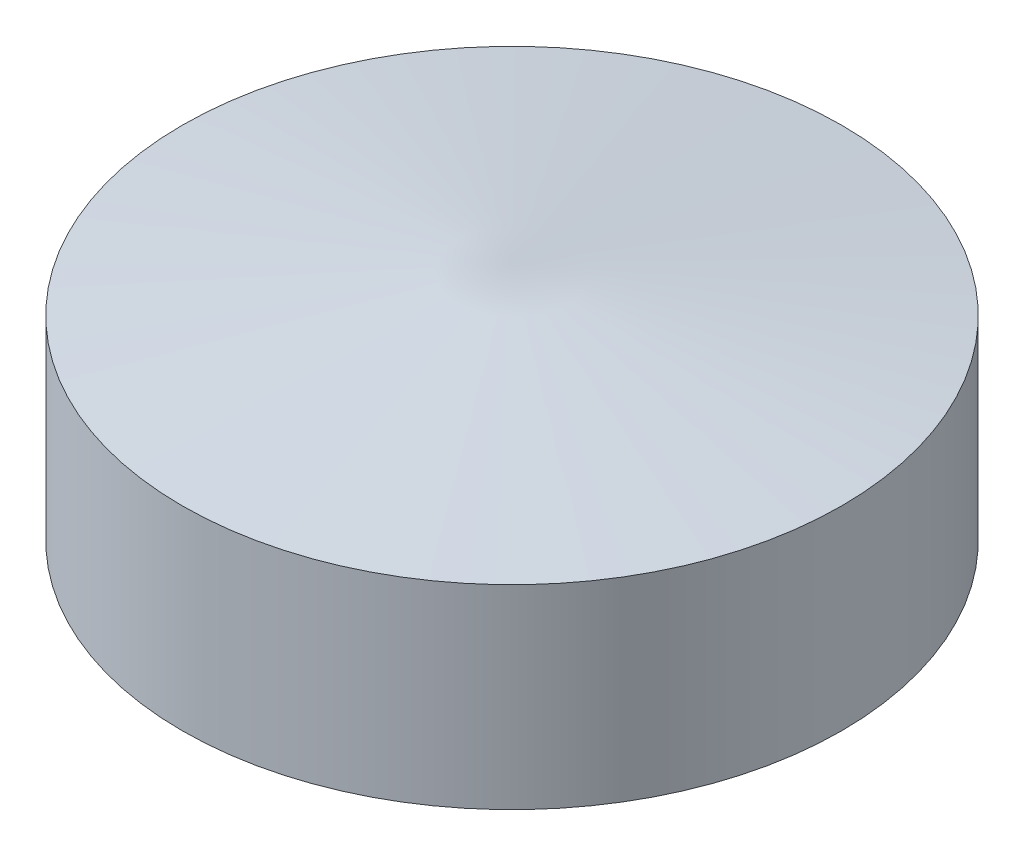
ISO-10303-21;
HEADER;
FILE_DESCRIPTION(('STEP AP214'),'2;1');
FILE_NAME('part.step','',(''),(''),'','','');
FILE_SCHEMA(('AUTOMOTIVE_DESIGN { 1 0 10303 214 1 1 1 1 }'));
ENDSEC;
DATA;
#1=APPLICATION_CONTEXT('core data for automotive mechanical design processes');
#2=APPLICATION_PROTOCOL_DEFINITION('international standard','automotive_design',2000,#1);
#3=PRODUCT_CONTEXT('',#1,'mechanical');
#4=PRODUCT('Part','Part','',(#3));
#5=PRODUCT_RELATED_PRODUCT_CATEGORY('part','',(#4));
#6=PRODUCT_DEFINITION_FORMATION('','',#4);
#7=PRODUCT_DEFINITION_CONTEXT('part definition',#1,'design');
#8=PRODUCT_DEFINITION('design','',#6,#7);
#9=PRODUCT_DEFINITION_SHAPE('','',#8);
#10=(LENGTH_UNIT() NAMED_UNIT(*) SI_UNIT(.MILLI.,.METRE.));
#11=(NAMED_UNIT(*) PLANE_ANGLE_UNIT() SI_UNIT($,.RADIAN.));
#12=(NAMED_UNIT(*) SI_UNIT($,.STERADIAN.) SOLID_ANGLE_UNIT());
#13=UNCERTAINTY_MEASURE_WITH_UNIT(LENGTH_MEASURE(1.E-05),#10,'distance_accuracy_value','');
#14=(GEOMETRIC_REPRESENTATION_CONTEXT(3) GLOBAL_UNCERTAINTY_ASSIGNED_CONTEXT((#13)) GLOBAL_UNIT_ASSIGNED_CONTEXT((#10,
#11,#12)) REPRESENTATION_CONTEXT('',''));
#15=CARTESIAN_POINT('',(0.,0.,0.));
#16=DIRECTION('',(0.,0.,1.));
#17=DIRECTION('',(1.,0.,0.));
#18=AXIS2_PLACEMENT_3D('',#15,#16,#17);
#19=CARTESIAN_POINT('',(0.,0.,0.));
#20=DIRECTION('',(0.,-1.,0.));
#21=DIRECTION('',(0.,0.,-1.));
#22=AXIS2_PLACEMENT_3D('',#19,#20,#21);
#23=CYLINDRICAL_SURFACE('',#22,22.);
#24=CARTESIAN_POINT('',(0.,13.,0.));
#25=DIRECTION('',(0.,-1.,0.));
#26=DIRECTION('',(0.,0.,-1.));
#27=AXIS2_PLACEMENT_3D('',#24,#25,#26);
#28=CIRCLE('',#27,22.);
#29=CARTESIAN_POINT('',(0.,13.,-22.));
#30=VERTEX_POINT('',#29);
#31=EDGE_CURVE('E72',#30,#30,#28,.T.);
#32=ORIENTED_EDGE('',*,*,#31,.T.);
#33=EDGE_LOOP('',(#32));
#34=FACE_BOUND('',#33,.T.);
#35=CARTESIAN_POINT('',(0.,0.,0.));
#36=DIRECTION('',(0.,-1.,0.));
#37=DIRECTION('',(0.,0.,-1.));
#38=AXIS2_PLACEMENT_3D('',#35,#36,#37);
#39=CIRCLE('',#38,22.);
#40=CARTESIAN_POINT('',(-21.9488636363636,0.,-1.49912810403716));
#41=VERTEX_POINT('',#40);
#42=CARTESIAN_POINT('',(-21.9488636363636,0.,1.49912810403716));
#43=VERTEX_POINT('',#42);
#44=EDGE_CURVE('E70',#41,#43,#39,.T.);
#45=ORIENTED_EDGE('',*,*,#44,.F.);
#46=DIRECTION('',(0.,-1.,0.));
#47=VECTOR('',#46,1.);
#48=CARTESIAN_POINT('',(-21.9488636363636,5.,-1.49912810403716));
#49=LINE('',#48,#47);
#50=CARTESIAN_POINT('',(-21.9488636363636,10.,-1.49912810403716));
#51=VERTEX_POINT('',#50);
#52=EDGE_CURVE('E11',#41,#51,#49,.F.);
#53=ORIENTED_EDGE('',*,*,#52,.T.);
#54=CARTESIAN_POINT('',(0.,10.,0.));
#55=DIRECTION('',(0.,1.,0.));
#56=DIRECTION('',(0.,0.,1.));
#57=AXIS2_PLACEMENT_3D('',#54,#55,#56);
#58=CIRCLE('',#57,22.);
#59=CARTESIAN_POINT('',(-21.9488636363636,10.,1.49912810403716));
#60=VERTEX_POINT('',#59);
#61=EDGE_CURVE('E71',#60,#51,#58,.F.);
#62=ORIENTED_EDGE('',*,*,#61,.F.);
#63=DIRECTION('',(0.,-1.,0.));
#64=VECTOR('',#63,1.);
#65=CARTESIAN_POINT('',(-21.9488636363636,5.,1.49912810403716));
#66=LINE('',#65,#64);
#67=EDGE_CURVE('E41',#60,#43,#66,.T.);
#68=ORIENTED_EDGE('',*,*,#67,.T.);
#69=EDGE_LOOP('',(#45,#53,#62,#68));
#70=FACE_BOUND('',#69,.T.);
#71=ADVANCED_FACE('F33',(#34,#70),#23,.T.);
#72=CARTESIAN_POINT('',(0.,0.,0.));
#73=DIRECTION('',(0.,-1.,0.));
#74=DIRECTION('',(0.,0.,-1.));
#75=AXIS2_PLACEMENT_3D('',#72,#73,#74);
#76=PLANE('',#75);
#77=ORIENTED_EDGE('',*,*,#44,.T.);
#78=CARTESIAN_POINT('',(-22.,0.,0.));
#79=DIRECTION('',(0.,1.,0.));
#80=DIRECTION('',(0.,0.,1.));
#81=AXIS2_PLACEMENT_3D('',#78,#79,#80);
#82=CIRCLE('',#81,1.5);
#83=EDGE_CURVE('E61',#43,#41,#82,.T.);
#84=ORIENTED_EDGE('',*,*,#83,.T.);
#85=EDGE_LOOP('',(#77,#84));
#86=FACE_BOUND('',#85,.T.);
#87=ADVANCED_FACE('F35',(#86),#76,.T.);
#88=CARTESIAN_POINT('',(0.,13.,0.));
#89=DIRECTION('',(0.,-1.,0.));
#90=DIRECTION('',(0.,0.,-1.));
#91=AXIS2_PLACEMENT_3D('',#88,#89,#90);
#92=CONICAL_SURFACE('',#91,22.,1.4352686128094);
#93=CARTESIAN_POINT('',(0.,16.,0.));
#94=VERTEX_POINT('',#93);
#95=VERTEX_LOOP('',#94);
#96=FACE_BOUND('',#95,.T.);
#97=ORIENTED_EDGE('',*,*,#31,.F.);
#98=EDGE_LOOP('',(#97));
#99=FACE_BOUND('',#98,.T.);
#100=ADVANCED_FACE('F81',(#96,#99),#92,.T.);
#101=CARTESIAN_POINT('',(-22.,10.,0.));
#102=DIRECTION('',(0.,-1.,0.));
#103=DIRECTION('',(0.,0.,-1.));
#104=AXIS2_PLACEMENT_3D('',#101,#102,#103);
#105=CYLINDRICAL_SURFACE('',#104,1.5);
#106=ORIENTED_EDGE('',*,*,#83,.F.);
#107=ORIENTED_EDGE('',*,*,#67,.F.);
#108=CARTESIAN_POINT('',(-22.,10.,0.));
#109=DIRECTION('',(0.,1.,0.));
#110=DIRECTION('',(0.,0.,1.));
#111=AXIS2_PLACEMENT_3D('',#108,#109,#110);
#112=CIRCLE('',#111,1.5);
#113=EDGE_CURVE('E47',#60,#51,#112,.T.);
#114=ORIENTED_EDGE('',*,*,#113,.T.);
#115=ORIENTED_EDGE('',*,*,#52,.F.);
#116=EDGE_LOOP('',(#106,#107,#114,#115));
#117=FACE_BOUND('',#116,.T.);
#118=ADVANCED_FACE('F63',(#117),#105,.F.);
#119=CARTESIAN_POINT('',(-22.,10.,0.));
#120=DIRECTION('',(0.,1.,0.));
#121=DIRECTION('',(0.,0.,1.));
#122=AXIS2_PLACEMENT_3D('',#119,#120,#121);
#123=PLANE('',#122);
#124=ORIENTED_EDGE('',*,*,#61,.T.);
#125=ORIENTED_EDGE('',*,*,#113,.F.);
#126=EDGE_LOOP('',(#124,#125));
#127=FACE_BOUND('',#126,.T.);
#128=ADVANCED_FACE('F88',(#127),#123,.F.);
#129=CLOSED_SHELL('',(#71,#87,#100,#118,#128));
#130=MANIFOLD_SOLID_BREP('B2',#129);
#131=ADVANCED_BREP_SHAPE_REPRESENTATION('',(#18,#130),#14);
#132=SHAPE_DEFINITION_REPRESENTATION(#9,#131);
ENDSEC;
END-ISO-10303-21;
